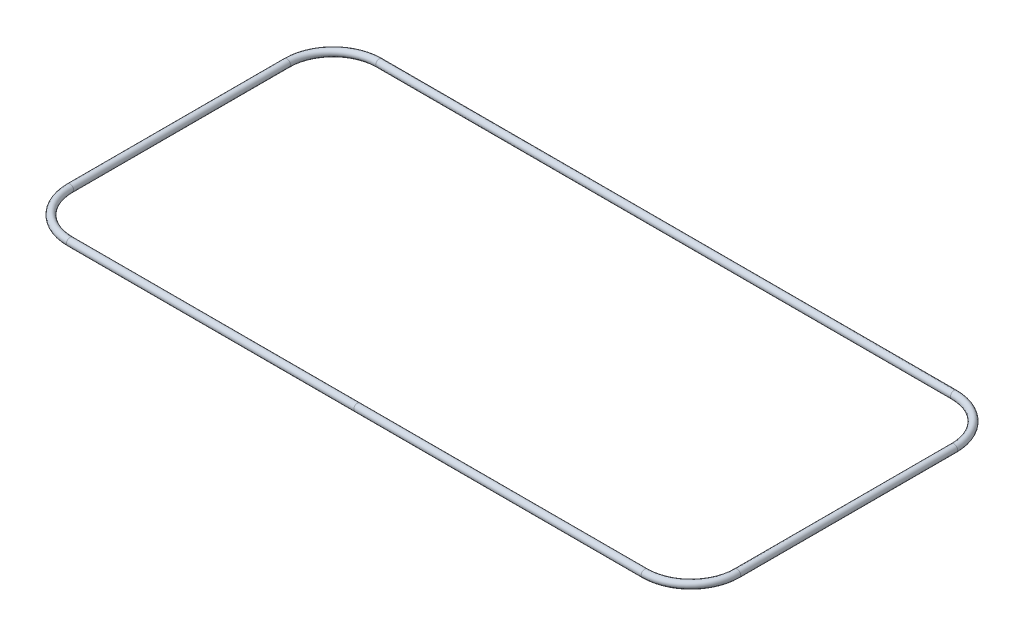
ISO-10303-21;
HEADER;
FILE_DESCRIPTION(('STEP AP214'),'2;1');
FILE_NAME('part.step','',(''),(''),'','','');
FILE_SCHEMA(('AUTOMOTIVE_DESIGN { 1 0 10303 214 1 1 1 1 }'));
ENDSEC;
DATA;
#1=APPLICATION_CONTEXT('core data for automotive mechanical design processes');
#2=APPLICATION_PROTOCOL_DEFINITION('international standard','automotive_design',2000,#1);
#3=PRODUCT_CONTEXT('',#1,'mechanical');
#4=PRODUCT('Part','Part','',(#3));
#5=PRODUCT_RELATED_PRODUCT_CATEGORY('part','',(#4));
#6=PRODUCT_DEFINITION_FORMATION('','',#4);
#7=PRODUCT_DEFINITION_CONTEXT('part definition',#1,'design');
#8=PRODUCT_DEFINITION('design','',#6,#7);
#9=PRODUCT_DEFINITION_SHAPE('','',#8);
#10=(LENGTH_UNIT() NAMED_UNIT(*) SI_UNIT(.MILLI.,.METRE.));
#11=(NAMED_UNIT(*) PLANE_ANGLE_UNIT() SI_UNIT($,.RADIAN.));
#12=(NAMED_UNIT(*) SI_UNIT($,.STERADIAN.) SOLID_ANGLE_UNIT());
#13=UNCERTAINTY_MEASURE_WITH_UNIT(LENGTH_MEASURE(1.E-05),#10,'distance_accuracy_value','');
#14=(GEOMETRIC_REPRESENTATION_CONTEXT(3) GLOBAL_UNCERTAINTY_ASSIGNED_CONTEXT((#13)) GLOBAL_UNIT_ASSIGNED_CONTEXT((#10,
#11,#12)) REPRESENTATION_CONTEXT('',''));
#15=CARTESIAN_POINT('',(0.,0.,0.));
#16=DIRECTION('',(0.,0.,1.));
#17=DIRECTION('',(1.,0.,0.));
#18=AXIS2_PLACEMENT_3D('',#15,#16,#17);
#19=CARTESIAN_POINT('',(0.,0.,76.8480288169552));
#20=DIRECTION('',(-1.,0.,0.));
#21=DIRECTION('',(0.,0.,1.));
#22=AXIS2_PLACEMENT_3D('',#19,#20,#21);
#23=CYLINDRICAL_SURFACE('',#22,1.76529999999999);
#24=CARTESIAN_POINT('',(-142.799128816955,0.,76.8480288169552));
#25=DIRECTION('',(1.,0.,0.));
#26=DIRECTION('',(0.,0.,-1.));
#27=AXIS2_PLACEMENT_3D('',#24,#25,#26);
#28=CIRCLE('',#27,1.76529999999999);
#29=CARTESIAN_POINT('',(-142.799128816955,0.,78.6133288169552));
#30=VERTEX_POINT('',#29);
#31=EDGE_CURVE('E73',#30,#30,#28,.T.);
#32=ORIENTED_EDGE('',*,*,#31,.T.);
#33=EDGE_LOOP('',(#32));
#34=FACE_BOUND('',#33,.T.);
#35=CARTESIAN_POINT('',(0.,0.,76.8480288169552));
#36=DIRECTION('',(1.,0.,0.));
#37=DIRECTION('',(0.,0.,-1.));
#38=AXIS2_PLACEMENT_3D('',#35,#36,#37);
#39=CIRCLE('',#38,1.76529999999999);
#40=CARTESIAN_POINT('',(0.,0.,75.0827288169552));
#41=VERTEX_POINT('',#40);
#42=EDGE_CURVE('E77',#41,#41,#39,.T.);
#43=ORIENTED_EDGE('',*,*,#42,.F.);
#44=EDGE_LOOP('',(#43));
#45=FACE_BOUND('',#44,.T.);
#46=ADVANCED_FACE('F37',(#34,#45),#23,.T.);
#47=CARTESIAN_POINT('',(-142.799128816955,0.,53.8991288169552));
#48=DIRECTION('',(0.,-1.,0.));
#49=DIRECTION('',(0.,0.,-1.));
#50=AXIS2_PLACEMENT_3D('',#47,#48,#49);
#51=TOROIDAL_SURFACE('',#50,22.9489,1.76529999999999);
#52=CARTESIAN_POINT('',(-165.748028816955,0.,53.8991288169552));
#53=DIRECTION('',(0.,0.,1.));
#54=DIRECTION('',(1.,0.,0.));
#55=AXIS2_PLACEMENT_3D('',#52,#53,#54);
#56=CIRCLE('',#55,1.76529999999999);
#57=CARTESIAN_POINT('',(-167.513328816955,0.,53.8991288169552));
#58=VERTEX_POINT('',#57);
#59=EDGE_CURVE('E69',#58,#58,#56,.T.);
#60=CARTESIAN_POINT('',(-142.799128816955,0.,53.8991288169552));
#61=DIRECTION('',(0.,-1.,0.));
#62=DIRECTION('',(0.,0.,-1.));
#63=AXIS2_PLACEMENT_3D('',#60,#61,#62);
#64=CIRCLE('',#63,24.7142);
#65=EDGE_CURVE('',#30,#58,#64,.T.);
#66=ORIENTED_EDGE('',*,*,#31,.F.);
#67=ORIENTED_EDGE('',*,*,#59,.T.);
#68=ORIENTED_EDGE('',*,*,#65,.T.);
#69=ORIENTED_EDGE('',*,*,#65,.F.);
#70=EDGE_LOOP('',(#66,#68,#67,#69));
#71=FACE_BOUND('',#70,.T.);
#72=ADVANCED_FACE('F85',(#71),#51,.T.);
#73=CARTESIAN_POINT('',(-165.748028816955,0.,53.8991288169552));
#74=DIRECTION('',(0.,0.,-1.));
#75=DIRECTION('',(-1.,0.,0.));
#76=AXIS2_PLACEMENT_3D('',#73,#74,#75);
#77=CYLINDRICAL_SURFACE('',#76,1.76529999999999);
#78=CARTESIAN_POINT('',(-165.748028816955,0.,-53.8991288169552));
#79=DIRECTION('',(0.,0.,1.));
#80=DIRECTION('',(1.,0.,0.));
#81=AXIS2_PLACEMENT_3D('',#78,#79,#80);
#82=CIRCLE('',#81,1.76529999999999);
#83=CARTESIAN_POINT('',(-167.513328816955,0.,-53.8991288169552));
#84=VERTEX_POINT('',#83);
#85=EDGE_CURVE('E65',#84,#84,#82,.T.);
#86=ORIENTED_EDGE('',*,*,#85,.T.);
#87=EDGE_LOOP('',(#86));
#88=FACE_BOUND('',#87,.T.);
#89=ORIENTED_EDGE('',*,*,#59,.F.);
#90=EDGE_LOOP('',(#89));
#91=FACE_BOUND('',#90,.T.);
#92=ADVANCED_FACE('F91',(#88,#91),#77,.T.);
#93=CARTESIAN_POINT('',(-142.799128816955,0.,-53.8991288169552));
#94=DIRECTION('',(0.,-1.,0.));
#95=DIRECTION('',(0.,0.,-1.));
#96=AXIS2_PLACEMENT_3D('',#93,#94,#95);
#97=TOROIDAL_SURFACE('',#96,22.9489,1.76529999999999);
#98=CARTESIAN_POINT('',(-142.799128816955,0.,-76.8480288169552));
#99=DIRECTION('',(-1.,0.,0.));
#100=DIRECTION('',(0.,0.,1.));
#101=AXIS2_PLACEMENT_3D('',#98,#99,#100);
#102=CIRCLE('',#101,1.76529999999999);
#103=CARTESIAN_POINT('',(-142.799128816955,0.,-78.6133288169552));
#104=VERTEX_POINT('',#103);
#105=EDGE_CURVE('E61',#104,#104,#102,.T.);
#106=CARTESIAN_POINT('',(-142.799128816955,0.,-53.8991288169552));
#107=DIRECTION('',(0.,-1.,0.));
#108=DIRECTION('',(0.,0.,-1.));
#109=AXIS2_PLACEMENT_3D('',#106,#107,#108);
#110=CIRCLE('',#109,24.7142);
#111=EDGE_CURVE('',#84,#104,#110,.T.);
#112=ORIENTED_EDGE('',*,*,#85,.F.);
#113=ORIENTED_EDGE('',*,*,#105,.T.);
#114=ORIENTED_EDGE('',*,*,#111,.T.);
#115=ORIENTED_EDGE('',*,*,#111,.F.);
#116=EDGE_LOOP('',(#112,#114,#113,#115));
#117=FACE_BOUND('',#116,.T.);
#118=ADVANCED_FACE('F97',(#117),#97,.T.);
#119=CARTESIAN_POINT('',(-142.799128816955,0.,-76.8480288169552));
#120=DIRECTION('',(1.,0.,0.));
#121=DIRECTION('',(0.,0.,-1.));
#122=AXIS2_PLACEMENT_3D('',#119,#120,#121);
#123=CYLINDRICAL_SURFACE('',#122,1.76529999999999);
#124=CARTESIAN_POINT('',(142.799128816955,0.,-76.8480288169552));
#125=DIRECTION('',(-1.,0.,0.));
#126=DIRECTION('',(0.,0.,1.));
#127=AXIS2_PLACEMENT_3D('',#124,#125,#126);
#128=CIRCLE('',#127,1.76529999999999);
#129=CARTESIAN_POINT('',(142.799128816955,0.,-78.6133288169552));
#130=VERTEX_POINT('',#129);
#131=EDGE_CURVE('E55',#130,#130,#128,.T.);
#132=ORIENTED_EDGE('',*,*,#131,.T.);
#133=EDGE_LOOP('',(#132));
#134=FACE_BOUND('',#133,.T.);
#135=ORIENTED_EDGE('',*,*,#105,.F.);
#136=EDGE_LOOP('',(#135));
#137=FACE_BOUND('',#136,.T.);
#138=ADVANCED_FACE('F101',(#134,#137),#123,.T.);
#139=CARTESIAN_POINT('',(142.799128816955,0.,-53.8991288169552));
#140=DIRECTION('',(0.,-1.,0.));
#141=DIRECTION('',(0.,0.,-1.));
#142=AXIS2_PLACEMENT_3D('',#139,#140,#141);
#143=TOROIDAL_SURFACE('',#142,22.9489,1.76529999999999);
#144=CARTESIAN_POINT('',(165.748028816955,0.,-53.8991288169552));
#145=DIRECTION('',(0.,0.,-1.));
#146=DIRECTION('',(-1.,0.,0.));
#147=AXIS2_PLACEMENT_3D('',#144,#145,#146);
#148=CIRCLE('',#147,1.76529999999999);
#149=CARTESIAN_POINT('',(167.513328816955,0.,-53.8991288169552));
#150=VERTEX_POINT('',#149);
#151=EDGE_CURVE('E50',#150,#150,#148,.T.);
#152=CARTESIAN_POINT('',(142.799128816955,0.,-53.8991288169552));
#153=DIRECTION('',(0.,-1.,0.));
#154=DIRECTION('',(0.,0.,-1.));
#155=AXIS2_PLACEMENT_3D('',#152,#153,#154);
#156=CIRCLE('',#155,24.7142);
#157=EDGE_CURVE('',#130,#150,#156,.T.);
#158=ORIENTED_EDGE('',*,*,#131,.F.);
#159=ORIENTED_EDGE('',*,*,#151,.T.);
#160=ORIENTED_EDGE('',*,*,#157,.T.);
#161=ORIENTED_EDGE('',*,*,#157,.F.);
#162=EDGE_LOOP('',(#158,#160,#159,#161));
#163=FACE_BOUND('',#162,.T.);
#164=ADVANCED_FACE('F105',(#163),#143,.T.);
#165=CARTESIAN_POINT('',(165.748028816955,0.,-53.8991288169552));
#166=DIRECTION('',(0.,0.,1.));
#167=DIRECTION('',(1.,0.,0.));
#168=AXIS2_PLACEMENT_3D('',#165,#166,#167);
#169=CYLINDRICAL_SURFACE('',#168,1.76529999999999);
#170=CARTESIAN_POINT('',(165.748028816955,0.,53.8991288169552));
#171=DIRECTION('',(0.,0.,-1.));
#172=DIRECTION('',(-1.,0.,0.));
#173=AXIS2_PLACEMENT_3D('',#170,#171,#172);
#174=CIRCLE('',#173,1.76529999999999);
#175=CARTESIAN_POINT('',(167.513328816955,0.,53.8991288169552));
#176=VERTEX_POINT('',#175);
#177=EDGE_CURVE('E45',#176,#176,#174,.T.);
#178=ORIENTED_EDGE('',*,*,#177,.T.);
#179=EDGE_LOOP('',(#178));
#180=FACE_BOUND('',#179,.T.);
#181=ORIENTED_EDGE('',*,*,#151,.F.);
#182=EDGE_LOOP('',(#181));
#183=FACE_BOUND('',#182,.T.);
#184=ADVANCED_FACE('F109',(#180,#183),#169,.T.);
#185=CARTESIAN_POINT('',(142.799128816955,0.,53.8991288169552));
#186=DIRECTION('',(0.,-1.,0.));
#187=DIRECTION('',(0.,0.,-1.));
#188=AXIS2_PLACEMENT_3D('',#185,#186,#187);
#189=TOROIDAL_SURFACE('',#188,22.9489,1.76529999999999);
#190=CARTESIAN_POINT('',(142.799128816955,0.,76.8480288169552));
#191=DIRECTION('',(1.,0.,0.));
#192=DIRECTION('',(0.,0.,-1.));
#193=AXIS2_PLACEMENT_3D('',#190,#191,#192);
#194=CIRCLE('',#193,1.76529999999999);
#195=CARTESIAN_POINT('',(142.799128816955,0.,78.6133288169552));
#196=VERTEX_POINT('',#195);
#197=EDGE_CURVE('E10',#196,#196,#194,.T.);
#198=CARTESIAN_POINT('',(142.799128816955,0.,53.8991288169552));
#199=DIRECTION('',(0.,-1.,0.));
#200=DIRECTION('',(0.,0.,-1.));
#201=AXIS2_PLACEMENT_3D('',#198,#199,#200);
#202=CIRCLE('',#201,24.7142);
#203=EDGE_CURVE('',#176,#196,#202,.T.);
#204=ORIENTED_EDGE('',*,*,#177,.F.);
#205=ORIENTED_EDGE('',*,*,#197,.T.);
#206=ORIENTED_EDGE('',*,*,#203,.T.);
#207=ORIENTED_EDGE('',*,*,#203,.F.);
#208=EDGE_LOOP('',(#204,#206,#205,#207));
#209=FACE_BOUND('',#208,.T.);
#210=ADVANCED_FACE('F112',(#209),#189,.T.);
#211=CARTESIAN_POINT('',(142.799128816955,0.,76.8480288169552));
#212=DIRECTION('',(-1.,0.,0.));
#213=DIRECTION('',(0.,0.,1.));
#214=AXIS2_PLACEMENT_3D('',#211,#212,#213);
#215=CYLINDRICAL_SURFACE('',#214,1.76529999999999);
#216=ORIENTED_EDGE('',*,*,#42,.T.);
#217=EDGE_LOOP('',(#216));
#218=FACE_BOUND('',#217,.T.);
#219=ORIENTED_EDGE('',*,*,#197,.F.);
#220=EDGE_LOOP('',(#219));
#221=FACE_BOUND('',#220,.T.);
#222=ADVANCED_FACE('F39',(#218,#221),#215,.T.);
#223=CLOSED_SHELL('',(#46,#72,#92,#118,#138,#164,#184,#210,#222));
#224=MANIFOLD_SOLID_BREP('B2',#223);
#225=ADVANCED_BREP_SHAPE_REPRESENTATION('',(#18,#224),#14);
#226=SHAPE_DEFINITION_REPRESENTATION(#9,#225);
ENDSEC;
END-ISO-10303-21;
